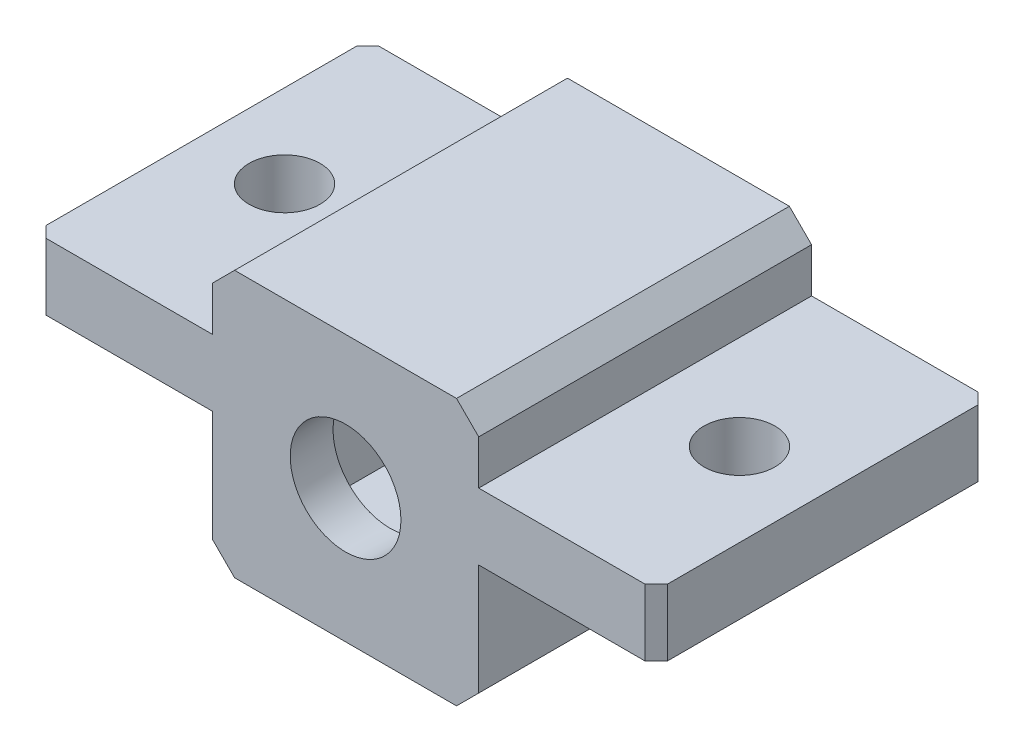
ISO-10303-21;
HEADER;
FILE_DESCRIPTION(('STEP AP214'),'2;1');
FILE_NAME('part.step','',(''),(''),'','','');
FILE_SCHEMA(('AUTOMOTIVE_DESIGN { 1 0 10303 214 1 1 1 1 }'));
ENDSEC;
DATA;
#1=APPLICATION_CONTEXT('core data for automotive mechanical design processes');
#2=APPLICATION_PROTOCOL_DEFINITION('international standard','automotive_design',2000,#1);
#3=PRODUCT_CONTEXT('',#1,'mechanical');
#4=PRODUCT('Part','Part','',(#3));
#5=PRODUCT_RELATED_PRODUCT_CATEGORY('part','',(#4));
#6=PRODUCT_DEFINITION_FORMATION('','',#4);
#7=PRODUCT_DEFINITION_CONTEXT('part definition',#1,'design');
#8=PRODUCT_DEFINITION('design','',#6,#7);
#9=PRODUCT_DEFINITION_SHAPE('','',#8);
#10=(LENGTH_UNIT() NAMED_UNIT(*) SI_UNIT(.MILLI.,.METRE.));
#11=(NAMED_UNIT(*) PLANE_ANGLE_UNIT() SI_UNIT($,.RADIAN.));
#12=(NAMED_UNIT(*) SI_UNIT($,.STERADIAN.) SOLID_ANGLE_UNIT());
#13=UNCERTAINTY_MEASURE_WITH_UNIT(LENGTH_MEASURE(1.E-05),#10,'distance_accuracy_value','');
#14=(GEOMETRIC_REPRESENTATION_CONTEXT(3) GLOBAL_UNCERTAINTY_ASSIGNED_CONTEXT((#13)) GLOBAL_UNIT_ASSIGNED_CONTEXT((#10,
#11,#12)) REPRESENTATION_CONTEXT('',''));
#15=CARTESIAN_POINT('',(0.,0.,0.));
#16=DIRECTION('',(0.,0.,1.));
#17=DIRECTION('',(1.,0.,0.));
#18=AXIS2_PLACEMENT_3D('',#15,#16,#17);
#19=CARTESIAN_POINT('',(-22.6304102547524,29.1826555023924,15.));
#20=DIRECTION('',(-1.,0.,0.));
#21=DIRECTION('',(0.,-1.,0.));
#22=AXIS2_PLACEMENT_3D('',#19,#20,#21);
#23=PLANE('',#22);
#24=DIRECTION('',(0.,1.,0.));
#25=VECTOR('',#24,1.);
#26=CARTESIAN_POINT('',(-22.6304102547524,29.1826555023924,15.));
#27=LINE('',#26,#25);
#28=CARTESIAN_POINT('',(-22.6304102547524,26.1826555023924,15.));
#29=VERTEX_POINT('',#28);
#30=CARTESIAN_POINT('',(-22.6304102547524,28.1826555023923,15.));
#31=VERTEX_POINT('',#30);
#32=EDGE_CURVE('E399',#29,#31,#27,.T.);
#33=ORIENTED_EDGE('',*,*,#32,.F.);
#34=DIRECTION('',(0.,0.,-1.));
#35=VECTOR('',#34,1.);
#36=CARTESIAN_POINT('',(-22.6304102547524,26.1826555023924,15.));
#37=LINE('',#36,#35);
#38=CARTESIAN_POINT('',(-22.6304102547524,26.1826555023923,0.));
#39=VERTEX_POINT('',#38);
#40=EDGE_CURVE('E221',#29,#39,#37,.T.);
#41=ORIENTED_EDGE('',*,*,#40,.T.);
#42=DIRECTION('',(0.,1.,0.));
#43=VECTOR('',#42,1.);
#44=CARTESIAN_POINT('',(-22.6304102547524,29.1826555023924,0.));
#45=LINE('',#44,#43);
#46=CARTESIAN_POINT('',(-22.6304102547524,28.1826555023923,0.));
#47=VERTEX_POINT('',#46);
#48=EDGE_CURVE('E229',#39,#47,#45,.T.);
#49=ORIENTED_EDGE('',*,*,#48,.T.);
#50=DIRECTION('',(0.,0.,1.));
#51=VECTOR('',#50,1.);
#52=CARTESIAN_POINT('',(-22.6304102547524,28.1826555023923,15.));
#53=LINE('',#52,#51);
#54=EDGE_CURVE('E243',#47,#31,#53,.T.);
#55=ORIENTED_EDGE('',*,*,#54,.T.);
#56=EDGE_LOOP('',(#33,#41,#49,#55));
#57=FACE_BOUND('',#56,.T.);
#58=ADVANCED_FACE('F37',(#57),#23,.F.);
#59=CARTESIAN_POINT('',(-34.6304102547524,29.1826555023924,15.));
#60=DIRECTION('',(1.,0.,0.));
#61=DIRECTION('',(0.,1.,0.));
#62=AXIS2_PLACEMENT_3D('',#59,#60,#61);
#63=PLANE('',#62);
#64=DIRECTION('',(0.,0.,1.));
#65=VECTOR('',#64,1.);
#66=CARTESIAN_POINT('',(-34.6304102547524,23.1826555023924,15.));
#67=LINE('',#66,#65);
#68=CARTESIAN_POINT('',(-34.6304102547524,23.1826555023924,0.));
#69=VERTEX_POINT('',#68);
#70=CARTESIAN_POINT('',(-34.6304102547524,23.1826555023924,15.));
#71=VERTEX_POINT('',#70);
#72=EDGE_CURVE('E344',#69,#71,#67,.T.);
#73=ORIENTED_EDGE('',*,*,#72,.F.);
#74=DIRECTION('',(0.,-1.,0.));
#75=VECTOR('',#74,1.);
#76=CARTESIAN_POINT('',(-34.6304102547524,29.1826555023924,0.));
#77=LINE('',#76,#75);
#78=CARTESIAN_POINT('',(-34.6304102547524,18.1826555023924,0.));
#79=VERTEX_POINT('',#78);
#80=EDGE_CURVE('E392',#69,#79,#77,.T.);
#81=ORIENTED_EDGE('',*,*,#80,.T.);
#82=DIRECTION('',(0.,0.,1.));
#83=VECTOR('',#82,1.);
#84=CARTESIAN_POINT('',(-34.6304102547524,18.1826555023924,15.));
#85=LINE('',#84,#83);
#86=CARTESIAN_POINT('',(-34.6304102547524,18.1826555023924,15.));
#87=VERTEX_POINT('',#86);
#88=EDGE_CURVE('E276',#79,#87,#85,.T.);
#89=ORIENTED_EDGE('',*,*,#88,.T.);
#90=DIRECTION('',(0.,-1.,0.));
#91=VECTOR('',#90,1.);
#92=CARTESIAN_POINT('',(-34.6304102547524,29.1826555023924,15.));
#93=LINE('',#92,#91);
#94=EDGE_CURVE('E232',#71,#87,#93,.T.);
#95=ORIENTED_EDGE('',*,*,#94,.F.);
#96=EDGE_LOOP('',(#73,#81,#89,#95));
#97=FACE_BOUND('',#96,.T.);
#98=ADVANCED_FACE('F412',(#97),#63,.F.);
#99=DIRECTION('',(0.,0.,-1.));
#100=VECTOR('',#99,1.);
#101=CARTESIAN_POINT('',(-34.6304102547524,26.1826555023924,15.));
#102=LINE('',#101,#100);
#103=CARTESIAN_POINT('',(-34.6304102547524,26.1826555023924,15.));
#104=VERTEX_POINT('',#103);
#105=CARTESIAN_POINT('',(-34.6304102547524,26.1826555023924,0.));
#106=VERTEX_POINT('',#105);
#107=EDGE_CURVE('E339',#104,#106,#102,.T.);
#108=ORIENTED_EDGE('',*,*,#107,.F.);
#109=CARTESIAN_POINT('',(-34.6304102547524,28.1826555023923,15.));
#110=VERTEX_POINT('',#109);
#111=EDGE_CURVE('E393',#110,#104,#93,.T.);
#112=ORIENTED_EDGE('',*,*,#111,.F.);
#113=DIRECTION('',(0.,0.,-1.));
#114=VECTOR('',#113,1.);
#115=CARTESIAN_POINT('',(-34.6304102547524,28.1826555023923,15.));
#116=LINE('',#115,#114);
#117=CARTESIAN_POINT('',(-34.6304102547524,28.1826555023923,0.));
#118=VERTEX_POINT('',#117);
#119=EDGE_CURVE('E279',#110,#118,#116,.T.);
#120=ORIENTED_EDGE('',*,*,#119,.T.);
#121=EDGE_CURVE('E403',#118,#106,#77,.T.);
#122=ORIENTED_EDGE('',*,*,#121,.T.);
#123=EDGE_LOOP('',(#108,#112,#120,#122));
#124=FACE_BOUND('',#123,.T.);
#125=ADVANCED_FACE('F442',(#124),#63,.F.);
#126=CARTESIAN_POINT('',(-28.6304102547524,23.1826555023924,12.));
#127=DIRECTION('',(0.,0.,-1.));
#128=DIRECTION('',(1.,0.,0.));
#129=AXIS2_PLACEMENT_3D('',#126,#127,#128);
#130=CONICAL_SURFACE('',#129,2.6,0.0349065850398866);
#131=CARTESIAN_POINT('',(-28.6304102547524,23.1826555023924,15.));
#132=DIRECTION('',(0.,0.,1.));
#133=DIRECTION('',(1.,0.,0.));
#134=AXIS2_PLACEMENT_3D('',#131,#132,#133);
#135=CIRCLE('',#134,2.49523769152476);
#136=CARTESIAN_POINT('',(-26.1351725632276,23.1826555023924,15.));
#137=VERTEX_POINT('',#136);
#138=EDGE_CURVE('E241',#137,#137,#135,.T.);
#139=ORIENTED_EDGE('',*,*,#138,.T.);
#140=EDGE_LOOP('',(#139));
#141=FACE_BOUND('',#140,.T.);
#142=CARTESIAN_POINT('',(-28.6304102547524,23.1826555023924,13.));
#143=DIRECTION('',(0.,0.,-1.));
#144=DIRECTION('',(-1.,0.,0.));
#145=AXIS2_PLACEMENT_3D('',#142,#143,#144);
#146=CIRCLE('',#145,2.56507923050825);
#147=CARTESIAN_POINT('',(-31.1954894852606,23.1826555023924,13.));
#148=VERTEX_POINT('',#147);
#149=EDGE_CURVE('E238',#148,#148,#146,.T.);
#150=ORIENTED_EDGE('',*,*,#149,.T.);
#151=EDGE_LOOP('',(#150));
#152=FACE_BOUND('',#151,.T.);
#153=ADVANCED_FACE('F454',(#141,#152),#130,.F.);
#154=CARTESIAN_POINT('',(-34.6304102547524,17.1826555023924,15.));
#155=DIRECTION('',(0.,1.,0.));
#156=DIRECTION('',(0.,0.,1.));
#157=AXIS2_PLACEMENT_3D('',#154,#155,#156);
#158=PLANE('',#157);
#159=DIRECTION('',(1.,0.,0.));
#160=VECTOR('',#159,1.);
#161=CARTESIAN_POINT('',(-34.6304102547524,17.1826555023924,0.));
#162=LINE('',#161,#160);
#163=CARTESIAN_POINT('',(-33.6304102547524,17.1826555023924,0.));
#164=VERTEX_POINT('',#163);
#165=CARTESIAN_POINT('',(-23.6304102547524,17.1826555023924,0.));
#166=VERTEX_POINT('',#165);
#167=EDGE_CURVE('E234',#164,#166,#162,.T.);
#168=ORIENTED_EDGE('',*,*,#167,.T.);
#169=DIRECTION('',(0.,0.,1.));
#170=VECTOR('',#169,1.);
#171=CARTESIAN_POINT('',(-23.6304102547524,17.1826555023924,15.));
#172=LINE('',#171,#170);
#173=CARTESIAN_POINT('',(-23.6304102547524,17.1826555023924,15.));
#174=VERTEX_POINT('',#173);
#175=EDGE_CURVE('E261',#166,#174,#172,.T.);
#176=ORIENTED_EDGE('',*,*,#175,.T.);
#177=DIRECTION('',(1.,0.,0.));
#178=VECTOR('',#177,1.);
#179=CARTESIAN_POINT('',(-34.6304102547524,17.1826555023924,15.));
#180=LINE('',#179,#178);
#181=CARTESIAN_POINT('',(-33.6304102547524,17.1826555023924,15.));
#182=VERTEX_POINT('',#181);
#183=EDGE_CURVE('E396',#182,#174,#180,.T.);
#184=ORIENTED_EDGE('',*,*,#183,.F.);
#185=DIRECTION('',(0.,0.,-1.));
#186=VECTOR('',#185,1.);
#187=CARTESIAN_POINT('',(-33.6304102547524,17.1826555023924,15.));
#188=LINE('',#187,#186);
#189=EDGE_CURVE('E258',#182,#164,#188,.T.);
#190=ORIENTED_EDGE('',*,*,#189,.T.);
#191=EDGE_LOOP('',(#168,#176,#184,#190));
#192=FACE_BOUND('',#191,.T.);
#193=ADVANCED_FACE('F426',(#192),#158,.F.);
#194=CARTESIAN_POINT('',(-22.6304102547524,18.1826555023924,0.));
#195=VERTEX_POINT('',#194);
#196=CARTESIAN_POINT('',(-22.6304102547524,23.1826555023924,0.));
#197=VERTEX_POINT('',#196);
#198=EDGE_CURVE('E207',#195,#197,#45,.T.);
#199=ORIENTED_EDGE('',*,*,#198,.T.);
#200=DIRECTION('',(0.,0.,1.));
#201=VECTOR('',#200,1.);
#202=CARTESIAN_POINT('',(-22.6304102547524,23.1826555023924,15.));
#203=LINE('',#202,#201);
#204=CARTESIAN_POINT('',(-22.6304102547524,23.1826555023924,15.));
#205=VERTEX_POINT('',#204);
#206=EDGE_CURVE('E215',#197,#205,#203,.T.);
#207=ORIENTED_EDGE('',*,*,#206,.T.);
#208=CARTESIAN_POINT('',(-22.6304102547524,18.1826555023924,15.));
#209=VERTEX_POINT('',#208);
#210=EDGE_CURVE('E400',#209,#205,#27,.T.);
#211=ORIENTED_EDGE('',*,*,#210,.F.);
#212=DIRECTION('',(0.,0.,-1.));
#213=VECTOR('',#212,1.);
#214=CARTESIAN_POINT('',(-22.6304102547524,18.1826555023924,15.));
#215=LINE('',#214,#213);
#216=EDGE_CURVE('E227',#209,#195,#215,.T.);
#217=ORIENTED_EDGE('',*,*,#216,.T.);
#218=EDGE_LOOP('',(#199,#207,#211,#217));
#219=FACE_BOUND('',#218,.T.);
#220=ADVANCED_FACE('F225',(#219),#23,.F.);
#221=CARTESIAN_POINT('',(-34.6304102547524,29.1826555023924,15.));
#222=DIRECTION('',(0.,-1.,0.));
#223=DIRECTION('',(0.,0.,-1.));
#224=AXIS2_PLACEMENT_3D('',#221,#222,#223);
#225=PLANE('',#224);
#226=DIRECTION('',(-1.,0.,0.));
#227=VECTOR('',#226,1.);
#228=CARTESIAN_POINT('',(-34.6304102547524,29.1826555023924,15.));
#229=LINE('',#228,#227);
#230=CARTESIAN_POINT('',(-23.6304102547524,29.1826555023924,15.));
#231=VERTEX_POINT('',#230);
#232=CARTESIAN_POINT('',(-33.6304102547524,29.1826555023924,15.));
#233=VERTEX_POINT('',#232);
#234=EDGE_CURVE('E246',#231,#233,#229,.T.);
#235=ORIENTED_EDGE('',*,*,#234,.F.);
#236=DIRECTION('',(0.,0.,-1.));
#237=VECTOR('',#236,1.);
#238=CARTESIAN_POINT('',(-23.6304102547524,29.1826555023924,15.));
#239=LINE('',#238,#237);
#240=CARTESIAN_POINT('',(-23.6304102547524,29.1826555023924,0.));
#241=VERTEX_POINT('',#240);
#242=EDGE_CURVE('E273',#231,#241,#239,.T.);
#243=ORIENTED_EDGE('',*,*,#242,.T.);
#244=DIRECTION('',(-1.,0.,0.));
#245=VECTOR('',#244,1.);
#246=CARTESIAN_POINT('',(-34.6304102547524,29.1826555023924,0.));
#247=LINE('',#246,#245);
#248=CARTESIAN_POINT('',(-33.6304102547524,29.1826555023924,0.));
#249=VERTEX_POINT('',#248);
#250=EDGE_CURVE('E228',#241,#249,#247,.T.);
#251=ORIENTED_EDGE('',*,*,#250,.T.);
#252=DIRECTION('',(0.,0.,1.));
#253=VECTOR('',#252,1.);
#254=CARTESIAN_POINT('',(-33.6304102547524,29.1826555023924,15.));
#255=LINE('',#254,#253);
#256=EDGE_CURVE('E271',#249,#233,#255,.T.);
#257=ORIENTED_EDGE('',*,*,#256,.T.);
#258=EDGE_LOOP('',(#235,#243,#251,#257));
#259=FACE_BOUND('',#258,.T.);
#260=ADVANCED_FACE('F448',(#259),#225,.F.);
#261=CARTESIAN_POINT('',(0.,0.,15.));
#262=DIRECTION('',(0.,0.,1.));
#263=DIRECTION('',(1.,0.,0.));
#264=AXIS2_PLACEMENT_3D('',#261,#262,#263);
#265=PLANE('',#264);
#266=ORIENTED_EDGE('',*,*,#138,.F.);
#267=EDGE_LOOP('',(#266));
#268=FACE_BOUND('',#267,.T.);
#269=DIRECTION('',(-1.,0.,0.));
#270=VECTOR('',#269,1.);
#271=CARTESIAN_POINT('',(-14.6304102547524,23.1826555023924,15.));
#272=LINE('',#271,#270);
#273=CARTESIAN_POINT('',(-15.1304102547524,23.1826555023924,15.));
#274=VERTEX_POINT('',#273);
#275=EDGE_CURVE('E211',#274,#205,#272,.T.);
#276=ORIENTED_EDGE('',*,*,#275,.F.);
#277=DIRECTION('',(0.,1.,0.));
#278=VECTOR('',#277,1.);
#279=CARTESIAN_POINT('',(-15.1304102547524,0.,15.));
#280=LINE('',#279,#278);
#281=CARTESIAN_POINT('',(-15.1304102547524,26.1826555023924,15.));
#282=VERTEX_POINT('',#281);
#283=EDGE_CURVE('E11',#274,#282,#280,.T.);
#284=ORIENTED_EDGE('',*,*,#283,.T.);
#285=DIRECTION('',(-1.,0.,0.));
#286=VECTOR('',#285,1.);
#287=CARTESIAN_POINT('',(-14.6304102547524,26.1826555023924,15.));
#288=LINE('',#287,#286);
#289=EDGE_CURVE('E319',#282,#29,#288,.T.);
#290=ORIENTED_EDGE('',*,*,#289,.T.);
#291=ORIENTED_EDGE('',*,*,#32,.T.);
#292=DIRECTION('',(0.707106781186545,-0.70710678118655,0.));
#293=VECTOR('',#292,1.);
#294=CARTESIAN_POINT('',(2.7761226238199,2.77612262381988,15.));
#295=LINE('',#294,#293);
#296=EDGE_CURVE('E267',#31,#231,#295,.F.);
#297=ORIENTED_EDGE('',*,*,#296,.T.);
#298=ORIENTED_EDGE('',*,*,#234,.T.);
#299=DIRECTION('',(0.707106781186549,0.707106781186546,0.));
#300=VECTOR('',#299,1.);
#301=CARTESIAN_POINT('',(-31.4065328785723,31.4065328785724,15.));
#302=LINE('',#301,#300);
#303=EDGE_CURVE('E265',#233,#110,#302,.F.);
#304=ORIENTED_EDGE('',*,*,#303,.T.);
#305=ORIENTED_EDGE('',*,*,#111,.T.);
#306=DIRECTION('',(1.,0.,0.));
#307=VECTOR('',#306,1.);
#308=CARTESIAN_POINT('',(-42.6304102547524,26.1826555023924,15.));
#309=LINE('',#308,#307);
#310=CARTESIAN_POINT('',(-42.1304102547524,26.1826555023924,15.));
#311=VERTEX_POINT('',#310);
#312=EDGE_CURVE('E357',#311,#104,#309,.T.);
#313=ORIENTED_EDGE('',*,*,#312,.F.);
#314=DIRECTION('',(0.,-1.,0.));
#315=VECTOR('',#314,1.);
#316=CARTESIAN_POINT('',(-42.1304102547524,0.,15.));
#317=LINE('',#316,#315);
#318=CARTESIAN_POINT('',(-42.1304102547524,23.1826555023924,15.));
#319=VERTEX_POINT('',#318);
#320=EDGE_CURVE('E298',#311,#319,#317,.T.);
#321=ORIENTED_EDGE('',*,*,#320,.T.);
#322=DIRECTION('',(1.,0.,0.));
#323=VECTOR('',#322,1.);
#324=CARTESIAN_POINT('',(-42.6304102547524,23.1826555023924,15.));
#325=LINE('',#324,#323);
#326=EDGE_CURVE('E347',#319,#71,#325,.T.);
#327=ORIENTED_EDGE('',*,*,#326,.T.);
#328=ORIENTED_EDGE('',*,*,#94,.T.);
#329=DIRECTION('',(-0.707106781186544,0.707106781186551,0.));
#330=VECTOR('',#329,1.);
#331=CARTESIAN_POINT('',(-8.2238773761802,-8.22387737618012,15.));
#332=LINE('',#331,#330);
#333=EDGE_CURVE('E263',#87,#182,#332,.F.);
#334=ORIENTED_EDGE('',*,*,#333,.T.);
#335=ORIENTED_EDGE('',*,*,#183,.T.);
#336=DIRECTION('',(-0.707106781186548,-0.707106781186548,0.));
#337=VECTOR('',#336,1.);
#338=CARTESIAN_POINT('',(-20.4065328785724,20.4065328785724,15.));
#339=LINE('',#338,#337);
#340=EDGE_CURVE('E269',#174,#209,#339,.F.);
#341=ORIENTED_EDGE('',*,*,#340,.T.);
#342=ORIENTED_EDGE('',*,*,#210,.T.);
#343=EDGE_LOOP('',(#276,#284,#290,#291,#297,#298,#304,#305,#313,#321,#327,#328,#334,#335,#341,#342));
#344=FACE_BOUND('',#343,.T.);
#345=ADVANCED_FACE('F423',(#268,#344),#265,.T.);
#346=CARTESIAN_POINT('',(0.,0.,0.));
#347=DIRECTION('',(0.,0.,1.));
#348=DIRECTION('',(1.,0.,0.));
#349=AXIS2_PLACEMENT_3D('',#346,#347,#348);
#350=PLANE('',#349);
#351=DIRECTION('',(-1.,0.,0.));
#352=VECTOR('',#351,1.);
#353=CARTESIAN_POINT('',(-24.6304102547524,19.1826555023924,0.));
#354=LINE('',#353,#352);
#355=CARTESIAN_POINT('',(-24.6304102547524,19.1826555023924,0.));
#356=VERTEX_POINT('',#355);
#357=CARTESIAN_POINT('',(-32.6304102547524,19.1826555023924,0.));
#358=VERTEX_POINT('',#357);
#359=EDGE_CURVE('E375',#356,#358,#354,.T.);
#360=ORIENTED_EDGE('',*,*,#359,.F.);
#361=DIRECTION('',(0.,-1.,0.));
#362=VECTOR('',#361,1.);
#363=CARTESIAN_POINT('',(-24.6304102547524,27.1826555023924,0.));
#364=LINE('',#363,#362);
#365=CARTESIAN_POINT('',(-24.6304102547524,27.1826555023924,0.));
#366=VERTEX_POINT('',#365);
#367=EDGE_CURVE('E359',#366,#356,#364,.T.);
#368=ORIENTED_EDGE('',*,*,#367,.F.);
#369=DIRECTION('',(1.,0.,0.));
#370=VECTOR('',#369,1.);
#371=CARTESIAN_POINT('',(-24.6304102547524,27.1826555023924,0.));
#372=LINE('',#371,#370);
#373=CARTESIAN_POINT('',(-32.6304102547524,27.1826555023924,0.));
#374=VERTEX_POINT('',#373);
#375=EDGE_CURVE('E364',#374,#366,#372,.T.);
#376=ORIENTED_EDGE('',*,*,#375,.F.);
#377=DIRECTION('',(0.,1.,0.));
#378=VECTOR('',#377,1.);
#379=CARTESIAN_POINT('',(-32.6304102547524,27.1826555023924,0.));
#380=LINE('',#379,#378);
#381=EDGE_CURVE('E378',#358,#374,#380,.T.);
#382=ORIENTED_EDGE('',*,*,#381,.F.);
#383=EDGE_LOOP('',(#360,#368,#376,#382));
#384=FACE_BOUND('',#383,.T.);
#385=DIRECTION('',(-1.,0.,0.));
#386=VECTOR('',#385,1.);
#387=CARTESIAN_POINT('',(-14.6304102547524,26.1826555023924,0.));
#388=LINE('',#387,#386);
#389=CARTESIAN_POINT('',(-15.1304102547524,26.1826555023924,0.));
#390=VERTEX_POINT('',#389);
#391=EDGE_CURVE('E212',#390,#39,#388,.T.);
#392=ORIENTED_EDGE('',*,*,#391,.F.);
#393=DIRECTION('',(0.,-1.,0.));
#394=VECTOR('',#393,1.);
#395=CARTESIAN_POINT('',(-15.1304102547524,23.1826555023924,0.));
#396=LINE('',#395,#394);
#397=CARTESIAN_POINT('',(-15.1304102547524,23.1826555023924,0.));
#398=VERTEX_POINT('',#397);
#399=EDGE_CURVE('E209',#390,#398,#396,.T.);
#400=ORIENTED_EDGE('',*,*,#399,.T.);
#401=DIRECTION('',(-1.,0.,0.));
#402=VECTOR('',#401,1.);
#403=CARTESIAN_POINT('',(-14.6304102547524,23.1826555023924,0.));
#404=LINE('',#403,#402);
#405=EDGE_CURVE('E202',#398,#197,#404,.T.);
#406=ORIENTED_EDGE('',*,*,#405,.T.);
#407=ORIENTED_EDGE('',*,*,#198,.F.);
#408=DIRECTION('',(0.707106781186548,0.707106781186548,0.));
#409=VECTOR('',#408,1.);
#410=CARTESIAN_POINT('',(-22.6304102547524,18.1826555023924,0.));
#411=LINE('',#410,#409);
#412=EDGE_CURVE('E256',#195,#166,#411,.F.);
#413=ORIENTED_EDGE('',*,*,#412,.T.);
#414=ORIENTED_EDGE('',*,*,#167,.F.);
#415=DIRECTION('',(0.707106781186544,-0.707106781186551,0.));
#416=VECTOR('',#415,1.);
#417=CARTESIAN_POINT('',(-33.6304102547524,17.1826555023924,0.));
#418=LINE('',#417,#416);
#419=EDGE_CURVE('E248',#164,#79,#418,.F.);
#420=ORIENTED_EDGE('',*,*,#419,.T.);
#421=ORIENTED_EDGE('',*,*,#80,.F.);
#422=DIRECTION('',(1.,0.,0.));
#423=VECTOR('',#422,1.);
#424=CARTESIAN_POINT('',(-42.6304102547524,23.1826555023924,0.));
#425=LINE('',#424,#423);
#426=CARTESIAN_POINT('',(-42.1304102547524,23.1826555023924,0.));
#427=VERTEX_POINT('',#426);
#428=EDGE_CURVE('E353',#427,#69,#425,.T.);
#429=ORIENTED_EDGE('',*,*,#428,.F.);
#430=DIRECTION('',(0.,1.,0.));
#431=VECTOR('',#430,1.);
#432=CARTESIAN_POINT('',(-42.1304102547524,26.1826555023924,0.));
#433=LINE('',#432,#431);
#434=CARTESIAN_POINT('',(-42.1304102547524,26.1826555023924,0.));
#435=VERTEX_POINT('',#434);
#436=EDGE_CURVE('E292',#427,#435,#433,.T.);
#437=ORIENTED_EDGE('',*,*,#436,.T.);
#438=DIRECTION('',(1.,0.,0.));
#439=VECTOR('',#438,1.);
#440=CARTESIAN_POINT('',(-42.6304102547524,26.1826555023924,0.));
#441=LINE('',#440,#439);
#442=EDGE_CURVE('E355',#435,#106,#441,.T.);
#443=ORIENTED_EDGE('',*,*,#442,.T.);
#444=ORIENTED_EDGE('',*,*,#121,.F.);
#445=DIRECTION('',(-0.707106781186549,-0.707106781186546,0.));
#446=VECTOR('',#445,1.);
#447=CARTESIAN_POINT('',(-34.6304102547524,28.1826555023923,0.));
#448=LINE('',#447,#446);
#449=EDGE_CURVE('E251',#118,#249,#448,.F.);
#450=ORIENTED_EDGE('',*,*,#449,.T.);
#451=ORIENTED_EDGE('',*,*,#250,.F.);
#452=DIRECTION('',(-0.707106781186545,0.70710678118655,0.));
#453=VECTOR('',#452,1.);
#454=CARTESIAN_POINT('',(-23.6304102547524,29.1826555023924,0.));
#455=LINE('',#454,#453);
#456=EDGE_CURVE('E253',#241,#47,#455,.F.);
#457=ORIENTED_EDGE('',*,*,#456,.T.);
#458=ORIENTED_EDGE('',*,*,#48,.F.);
#459=EDGE_LOOP('',(#392,#400,#406,#407,#413,#414,#420,#421,#429,#437,#443,#444,#450,#451,#457,#458));
#460=FACE_BOUND('',#459,.T.);
#461=ADVANCED_FACE('F205',(#384,#460),#350,.F.);
#462=CARTESIAN_POINT('',(-24.6304102547524,27.1826555023924,13.));
#463=DIRECTION('',(1.,0.,0.));
#464=DIRECTION('',(0.,0.,-1.));
#465=AXIS2_PLACEMENT_3D('',#462,#463,#464);
#466=PLANE('',#465);
#467=ORIENTED_EDGE('',*,*,#367,.T.);
#468=DIRECTION('',(0.,0.,-1.));
#469=VECTOR('',#468,1.);
#470=CARTESIAN_POINT('',(-24.6304102547524,19.1826555023924,13.));
#471=LINE('',#470,#469);
#472=CARTESIAN_POINT('',(-24.6304102547524,19.1826555023924,13.));
#473=VERTEX_POINT('',#472);
#474=EDGE_CURVE('E373',#473,#356,#471,.T.);
#475=ORIENTED_EDGE('',*,*,#474,.F.);
#476=DIRECTION('',(0.,-1.,0.));
#477=VECTOR('',#476,1.);
#478=CARTESIAN_POINT('',(-24.6304102547524,27.1826555023924,13.));
#479=LINE('',#478,#477);
#480=CARTESIAN_POINT('',(-24.6304102547524,27.1826555023924,13.));
#481=VERTEX_POINT('',#480);
#482=EDGE_CURVE('E360',#481,#473,#479,.T.);
#483=ORIENTED_EDGE('',*,*,#482,.F.);
#484=DIRECTION('',(0.,0.,-1.));
#485=VECTOR('',#484,1.);
#486=CARTESIAN_POINT('',(-24.6304102547524,27.1826555023924,13.));
#487=LINE('',#486,#485);
#488=EDGE_CURVE('E242',#481,#366,#487,.T.);
#489=ORIENTED_EDGE('',*,*,#488,.T.);
#490=EDGE_LOOP('',(#467,#475,#483,#489));
#491=FACE_BOUND('',#490,.T.);
#492=ADVANCED_FACE('F553',(#491),#466,.F.);
#493=CARTESIAN_POINT('',(-24.6304102547524,27.1826555023924,13.));
#494=DIRECTION('',(0.,1.,0.));
#495=DIRECTION('',(0.,0.,1.));
#496=AXIS2_PLACEMENT_3D('',#493,#494,#495);
#497=PLANE('',#496);
#498=ORIENTED_EDGE('',*,*,#375,.T.);
#499=ORIENTED_EDGE('',*,*,#488,.F.);
#500=DIRECTION('',(1.,0.,0.));
#501=VECTOR('',#500,1.);
#502=CARTESIAN_POINT('',(-24.6304102547524,27.1826555023924,13.));
#503=LINE('',#502,#501);
#504=CARTESIAN_POINT('',(-32.6304102547524,27.1826555023924,13.));
#505=VERTEX_POINT('',#504);
#506=EDGE_CURVE('E370',#505,#481,#503,.T.);
#507=ORIENTED_EDGE('',*,*,#506,.F.);
#508=DIRECTION('',(0.,0.,-1.));
#509=VECTOR('',#508,1.);
#510=CARTESIAN_POINT('',(-32.6304102547524,27.1826555023924,13.));
#511=LINE('',#510,#509);
#512=EDGE_CURVE('E384',#505,#374,#511,.T.);
#513=ORIENTED_EDGE('',*,*,#512,.T.);
#514=EDGE_LOOP('',(#498,#499,#507,#513));
#515=FACE_BOUND('',#514,.T.);
#516=ADVANCED_FACE('F557',(#515),#497,.F.);
#517=CARTESIAN_POINT('',(-32.6304102547524,27.1826555023924,13.));
#518=DIRECTION('',(-1.,0.,0.));
#519=DIRECTION('',(0.,-1.,0.));
#520=AXIS2_PLACEMENT_3D('',#517,#518,#519);
#521=PLANE('',#520);
#522=ORIENTED_EDGE('',*,*,#381,.T.);
#523=ORIENTED_EDGE('',*,*,#512,.F.);
#524=DIRECTION('',(0.,1.,0.));
#525=VECTOR('',#524,1.);
#526=CARTESIAN_POINT('',(-32.6304102547524,27.1826555023924,13.));
#527=LINE('',#526,#525);
#528=CARTESIAN_POINT('',(-32.6304102547524,19.1826555023924,13.));
#529=VERTEX_POINT('',#528);
#530=EDGE_CURVE('E367',#529,#505,#527,.T.);
#531=ORIENTED_EDGE('',*,*,#530,.F.);
#532=DIRECTION('',(0.,0.,-1.));
#533=VECTOR('',#532,1.);
#534=CARTESIAN_POINT('',(-32.6304102547524,19.1826555023924,13.));
#535=LINE('',#534,#533);
#536=EDGE_CURVE('E386',#529,#358,#535,.T.);
#537=ORIENTED_EDGE('',*,*,#536,.T.);
#538=EDGE_LOOP('',(#522,#523,#531,#537));
#539=FACE_BOUND('',#538,.T.);
#540=ADVANCED_FACE('F568',(#539),#521,.F.);
#541=CARTESIAN_POINT('',(-24.6304102547524,19.1826555023924,13.));
#542=DIRECTION('',(0.,-1.,0.));
#543=DIRECTION('',(0.,0.,-1.));
#544=AXIS2_PLACEMENT_3D('',#541,#542,#543);
#545=PLANE('',#544);
#546=ORIENTED_EDGE('',*,*,#359,.T.);
#547=ORIENTED_EDGE('',*,*,#536,.F.);
#548=DIRECTION('',(-1.,0.,0.));
#549=VECTOR('',#548,1.);
#550=CARTESIAN_POINT('',(-24.6304102547524,19.1826555023924,13.));
#551=LINE('',#550,#549);
#552=EDGE_CURVE('E363',#473,#529,#551,.T.);
#553=ORIENTED_EDGE('',*,*,#552,.F.);
#554=ORIENTED_EDGE('',*,*,#474,.T.);
#555=EDGE_LOOP('',(#546,#547,#553,#554));
#556=FACE_BOUND('',#555,.T.);
#557=ADVANCED_FACE('F578',(#556),#545,.F.);
#558=CARTESIAN_POINT('',(0.,0.,13.));
#559=DIRECTION('',(0.,0.,-1.));
#560=DIRECTION('',(-1.,0.,0.));
#561=AXIS2_PLACEMENT_3D('',#558,#559,#560);
#562=PLANE('',#561);
#563=ORIENTED_EDGE('',*,*,#149,.F.);
#564=EDGE_LOOP('',(#563));
#565=FACE_BOUND('',#564,.T.);
#566=ORIENTED_EDGE('',*,*,#482,.T.);
#567=ORIENTED_EDGE('',*,*,#552,.T.);
#568=ORIENTED_EDGE('',*,*,#530,.T.);
#569=ORIENTED_EDGE('',*,*,#506,.T.);
#570=EDGE_LOOP('',(#566,#567,#568,#569));
#571=FACE_BOUND('',#570,.T.);
#572=ADVANCED_FACE('F468',(#565,#571),#562,.T.);
#573=CARTESIAN_POINT('',(-22.6304102547524,18.1826555023924,15.));
#574=DIRECTION('',(-0.707106781186547,0.707106781186547,0.));
#575=DIRECTION('',(0.,0.,-1.));
#576=AXIS2_PLACEMENT_3D('',#573,#574,#575);
#577=PLANE('',#576);
#578=ORIENTED_EDGE('',*,*,#340,.F.);
#579=ORIENTED_EDGE('',*,*,#175,.F.);
#580=ORIENTED_EDGE('',*,*,#412,.F.);
#581=ORIENTED_EDGE('',*,*,#216,.F.);
#582=EDGE_LOOP('',(#578,#579,#580,#581));
#583=FACE_BOUND('',#582,.T.);
#584=ADVANCED_FACE('F429',(#583),#577,.F.);
#585=CARTESIAN_POINT('',(-23.6304102547524,29.1826555023924,15.));
#586=DIRECTION('',(-0.70710678118655,-0.707106781186545,0.));
#587=DIRECTION('',(0.,0.,-1.));
#588=AXIS2_PLACEMENT_3D('',#585,#586,#587);
#589=PLANE('',#588);
#590=ORIENTED_EDGE('',*,*,#296,.F.);
#591=ORIENTED_EDGE('',*,*,#54,.F.);
#592=ORIENTED_EDGE('',*,*,#456,.F.);
#593=ORIENTED_EDGE('',*,*,#242,.F.);
#594=EDGE_LOOP('',(#590,#591,#592,#593));
#595=FACE_BOUND('',#594,.T.);
#596=ADVANCED_FACE('F467',(#595),#589,.F.);
#597=CARTESIAN_POINT('',(-34.6304102547524,28.1826555023923,15.));
#598=DIRECTION('',(0.707106781186546,-0.707106781186549,0.));
#599=DIRECTION('',(0.,0.,-1.));
#600=AXIS2_PLACEMENT_3D('',#597,#598,#599);
#601=PLANE('',#600);
#602=ORIENTED_EDGE('',*,*,#303,.F.);
#603=ORIENTED_EDGE('',*,*,#256,.F.);
#604=ORIENTED_EDGE('',*,*,#449,.F.);
#605=ORIENTED_EDGE('',*,*,#119,.F.);
#606=EDGE_LOOP('',(#602,#603,#604,#605));
#607=FACE_BOUND('',#606,.T.);
#608=ADVANCED_FACE('F474',(#607),#601,.F.);
#609=CARTESIAN_POINT('',(-33.6304102547524,17.1826555023924,15.));
#610=DIRECTION('',(0.707106781186551,0.707106781186544,0.));
#611=DIRECTION('',(0.,0.,-1.));
#612=AXIS2_PLACEMENT_3D('',#609,#610,#611);
#613=PLANE('',#612);
#614=ORIENTED_EDGE('',*,*,#333,.F.);
#615=ORIENTED_EDGE('',*,*,#88,.F.);
#616=ORIENTED_EDGE('',*,*,#419,.F.);
#617=ORIENTED_EDGE('',*,*,#189,.F.);
#618=EDGE_LOOP('',(#614,#615,#616,#617));
#619=FACE_BOUND('',#618,.T.);
#620=ADVANCED_FACE('F420',(#619),#613,.F.);
#621=CARTESIAN_POINT('',(-42.6304102547524,26.1826555023924,15.));
#622=DIRECTION('',(0.,-1.,0.));
#623=DIRECTION('',(1.,0.,0.));
#624=AXIS2_PLACEMENT_3D('',#621,#622,#623);
#625=PLANE('',#624);
#626=CARTESIAN_POINT('',(-38.8804102547524,26.1826555023924,7.5));
#627=DIRECTION('',(0.,-1.,0.));
#628=DIRECTION('',(1.,0.,0.));
#629=AXIS2_PLACEMENT_3D('',#626,#627,#628);
#630=CIRCLE('',#629,1.6);
#631=CARTESIAN_POINT('',(-37.2804102547524,26.1826555023924,7.5));
#632=VERTEX_POINT('',#631);
#633=EDGE_CURVE('E336',#632,#632,#630,.T.);
#634=ORIENTED_EDGE('',*,*,#633,.T.);
#635=EDGE_LOOP('',(#634));
#636=FACE_BOUND('',#635,.T.);
#637=ORIENTED_EDGE('',*,*,#442,.F.);
#638=DIRECTION('',(-0.707106781186552,0.,0.707106781186543));
#639=VECTOR('',#638,1.);
#640=CARTESIAN_POINT('',(-42.6304102547524,26.1826555023924,0.49999999999999));
#641=LINE('',#640,#639);
#642=CARTESIAN_POINT('',(-42.6304102547524,26.1826555023924,0.5));
#643=VERTEX_POINT('',#642);
#644=EDGE_CURVE('E296',#435,#643,#641,.T.);
#645=ORIENTED_EDGE('',*,*,#644,.T.);
#646=DIRECTION('',(0.,0.,-1.));
#647=VECTOR('',#646,1.);
#648=CARTESIAN_POINT('',(-42.6304102547524,26.1826555023924,15.));
#649=LINE('',#648,#647);
#650=CARTESIAN_POINT('',(-42.6304102547524,26.1826555023924,14.5));
#651=VERTEX_POINT('',#650);
#652=EDGE_CURVE('E340',#651,#643,#649,.T.);
#653=ORIENTED_EDGE('',*,*,#652,.F.);
#654=DIRECTION('',(-0.707106781186545,0.,-0.70710678118655));
#655=VECTOR('',#654,1.);
#656=CARTESIAN_POINT('',(-42.6304102547524,26.1826555023924,14.5));
#657=LINE('',#656,#655);
#658=EDGE_CURVE('E294',#651,#311,#657,.F.);
#659=ORIENTED_EDGE('',*,*,#658,.T.);
#660=ORIENTED_EDGE('',*,*,#312,.T.);
#661=ORIENTED_EDGE('',*,*,#107,.T.);
#662=EDGE_LOOP('',(#637,#645,#653,#659,#660,#661));
#663=FACE_BOUND('',#662,.T.);
#664=ADVANCED_FACE('F487',(#636,#663),#625,.F.);
#665=CARTESIAN_POINT('',(-42.6304102547524,23.1826555023924,15.));
#666=DIRECTION('',(0.,1.,0.));
#667=DIRECTION('',(-1.,0.,0.));
#668=AXIS2_PLACEMENT_3D('',#665,#666,#667);
#669=PLANE('',#668);
#670=CARTESIAN_POINT('',(-38.8804102547524,23.1826555023924,7.5));
#671=DIRECTION('',(0.,-1.,0.));
#672=DIRECTION('',(1.,0.,0.));
#673=AXIS2_PLACEMENT_3D('',#670,#671,#672);
#674=CIRCLE('',#673,1.6);
#675=CARTESIAN_POINT('',(-37.2804102547524,23.1826555023924,7.5));
#676=VERTEX_POINT('',#675);
#677=EDGE_CURVE('E333',#676,#676,#674,.T.);
#678=ORIENTED_EDGE('',*,*,#677,.F.);
#679=EDGE_LOOP('',(#678));
#680=FACE_BOUND('',#679,.T.);
#681=DIRECTION('',(0.,0.,1.));
#682=VECTOR('',#681,1.);
#683=CARTESIAN_POINT('',(-42.6304102547524,23.1826555023924,15.));
#684=LINE('',#683,#682);
#685=CARTESIAN_POINT('',(-42.6304102547524,23.1826555023924,0.5));
#686=VERTEX_POINT('',#685);
#687=CARTESIAN_POINT('',(-42.6304102547524,23.1826555023924,14.5));
#688=VERTEX_POINT('',#687);
#689=EDGE_CURVE('E343',#686,#688,#684,.T.);
#690=ORIENTED_EDGE('',*,*,#689,.F.);
#691=DIRECTION('',(0.707106781186552,0.,-0.707106781186543));
#692=VECTOR('',#691,1.);
#693=CARTESIAN_POINT('',(-42.6304102547524,23.1826555023924,0.499999999999994));
#694=LINE('',#693,#692);
#695=EDGE_CURVE('E290',#686,#427,#694,.T.);
#696=ORIENTED_EDGE('',*,*,#695,.T.);
#697=ORIENTED_EDGE('',*,*,#428,.T.);
#698=ORIENTED_EDGE('',*,*,#72,.T.);
#699=ORIENTED_EDGE('',*,*,#326,.F.);
#700=DIRECTION('',(0.707106781186545,0.,0.70710678118655));
#701=VECTOR('',#700,1.);
#702=CARTESIAN_POINT('',(-42.6304102547524,23.1826555023924,14.5));
#703=LINE('',#702,#701);
#704=EDGE_CURVE('E288',#319,#688,#703,.F.);
#705=ORIENTED_EDGE('',*,*,#704,.T.);
#706=EDGE_LOOP('',(#690,#696,#697,#698,#699,#705));
#707=FACE_BOUND('',#706,.T.);
#708=ADVANCED_FACE('F517',(#680,#707),#669,.F.);
#709=CARTESIAN_POINT('',(-42.6304102547524,0.,0.));
#710=DIRECTION('',(-1.,0.,0.));
#711=DIRECTION('',(0.,0.,1.));
#712=AXIS2_PLACEMENT_3D('',#709,#710,#711);
#713=PLANE('',#712);
#714=ORIENTED_EDGE('',*,*,#652,.T.);
#715=DIRECTION('',(0.,-1.,0.));
#716=VECTOR('',#715,1.);
#717=CARTESIAN_POINT('',(-42.6304102547524,23.1826555023924,0.5));
#718=LINE('',#717,#716);
#719=EDGE_CURVE('E285',#643,#686,#718,.T.);
#720=ORIENTED_EDGE('',*,*,#719,.T.);
#721=ORIENTED_EDGE('',*,*,#689,.T.);
#722=DIRECTION('',(0.,1.,0.));
#723=VECTOR('',#722,1.);
#724=CARTESIAN_POINT('',(-42.6304102547524,0.,14.5));
#725=LINE('',#724,#723);
#726=EDGE_CURVE('E282',#688,#651,#725,.T.);
#727=ORIENTED_EDGE('',*,*,#726,.T.);
#728=EDGE_LOOP('',(#714,#720,#721,#727));
#729=FACE_BOUND('',#728,.T.);
#730=ADVANCED_FACE('F519',(#729),#713,.T.);
#731=CARTESIAN_POINT('',(-38.8804102547524,29.1826555023924,7.5));
#732=DIRECTION('',(0.,-1.,0.));
#733=DIRECTION('',(1.,0.,0.));
#734=AXIS2_PLACEMENT_3D('',#731,#732,#733);
#735=CYLINDRICAL_SURFACE('',#734,1.6);
#736=CARTESIAN_POINT('',(-37.2804102547524,23.1826555023924,7.5));
#737=CARTESIAN_POINT('',(-37.2804102547524,23.2139055023924,7.5));
#738=CARTESIAN_POINT('',(-37.2804102547524,23.2451555023924,7.5));
#739=CARTESIAN_POINT('',(-37.2804102547524,23.3076555023924,7.5));
#740=CARTESIAN_POINT('',(-37.2804102547524,23.3389055023924,7.5));
#741=CARTESIAN_POINT('',(-37.2804102547524,23.4014055023924,7.5));
#742=CARTESIAN_POINT('',(-37.2804102547524,23.4326555023924,7.5));
#743=CARTESIAN_POINT('',(-37.2804102547524,23.4951555023924,7.5));
#744=CARTESIAN_POINT('',(-37.2804102547524,23.5264055023924,7.5));
#745=CARTESIAN_POINT('',(-37.2804102547524,23.5889055023924,7.5));
#746=CARTESIAN_POINT('',(-37.2804102547524,23.6201555023924,7.5));
#747=CARTESIAN_POINT('',(-37.2804102547524,23.6826555023924,7.5));
#748=CARTESIAN_POINT('',(-37.2804102547524,23.7139055023924,7.5));
#749=CARTESIAN_POINT('',(-37.2804102547524,23.7764055023924,7.5));
#750=CARTESIAN_POINT('',(-37.2804102547524,23.8076555023924,7.5));
#751=CARTESIAN_POINT('',(-37.2804102547524,23.8701555023924,7.5));
#752=CARTESIAN_POINT('',(-37.2804102547524,23.9014055023924,7.5));
#753=CARTESIAN_POINT('',(-37.2804102547524,23.9639055023924,7.5));
#754=CARTESIAN_POINT('',(-37.2804102547524,23.9951555023924,7.5));
#755=CARTESIAN_POINT('',(-37.2804102547524,24.0576555023924,7.5));
#756=CARTESIAN_POINT('',(-37.2804102547524,24.0889055023924,7.5));
#757=CARTESIAN_POINT('',(-37.2804102547524,24.1514055023924,7.5));
#758=CARTESIAN_POINT('',(-37.2804102547524,24.1826555023924,7.5));
#759=CARTESIAN_POINT('',(-37.2804102547524,24.2451555023924,7.5));
#760=CARTESIAN_POINT('',(-37.2804102547524,24.2764055023924,7.5));
#761=CARTESIAN_POINT('',(-37.2804102547524,24.3389055023924,7.5));
#762=CARTESIAN_POINT('',(-37.2804102547524,24.3701555023924,7.5));
#763=CARTESIAN_POINT('',(-37.2804102547524,24.4326555023924,7.5));
#764=CARTESIAN_POINT('',(-37.2804102547524,24.4639055023924,7.5));
#765=CARTESIAN_POINT('',(-37.2804102547524,24.5264055023924,7.5));
#766=CARTESIAN_POINT('',(-37.2804102547524,24.5576555023924,7.5));
#767=CARTESIAN_POINT('',(-37.2804102547524,24.6201555023924,7.5));
#768=CARTESIAN_POINT('',(-37.2804102547524,24.6514055023924,7.5));
#769=CARTESIAN_POINT('',(-37.2804102547524,24.7139055023924,7.5));
#770=CARTESIAN_POINT('',(-37.2804102547524,24.7451555023924,7.5));
#771=CARTESIAN_POINT('',(-37.2804102547524,24.8076555023924,7.5));
#772=CARTESIAN_POINT('',(-37.2804102547524,24.8389055023924,7.5));
#773=CARTESIAN_POINT('',(-37.2804102547524,24.9014055023924,7.5));
#774=CARTESIAN_POINT('',(-37.2804102547524,24.9326555023924,7.5));
#775=CARTESIAN_POINT('',(-37.2804102547524,24.9951555023924,7.5));
#776=CARTESIAN_POINT('',(-37.2804102547524,25.0264055023924,7.5));
#777=CARTESIAN_POINT('',(-37.2804102547524,25.0889055023924,7.5));
#778=CARTESIAN_POINT('',(-37.2804102547524,25.1201555023924,7.5));
#779=CARTESIAN_POINT('',(-37.2804102547524,25.1826555023924,7.5));
#780=CARTESIAN_POINT('',(-37.2804102547524,25.2139055023924,7.5));
#781=CARTESIAN_POINT('',(-37.2804102547524,25.2764055023924,7.5));
#782=CARTESIAN_POINT('',(-37.2804102547524,25.3076555023924,7.5));
#783=CARTESIAN_POINT('',(-37.2804102547524,25.3701555023924,7.5));
#784=CARTESIAN_POINT('',(-37.2804102547524,25.4014055023924,7.5));
#785=CARTESIAN_POINT('',(-37.2804102547524,25.4639055023924,7.5));
#786=CARTESIAN_POINT('',(-37.2804102547524,25.4951555023924,7.5));
#787=CARTESIAN_POINT('',(-37.2804102547524,25.5576555023924,7.5));
#788=CARTESIAN_POINT('',(-37.2804102547524,25.5889055023924,7.5));
#789=CARTESIAN_POINT('',(-37.2804102547524,25.6514055023924,7.5));
#790=CARTESIAN_POINT('',(-37.2804102547524,25.6826555023924,7.5));
#791=CARTESIAN_POINT('',(-37.2804102547524,25.7451555023924,7.5));
#792=CARTESIAN_POINT('',(-37.2804102547524,25.7764055023924,7.5));
#793=CARTESIAN_POINT('',(-37.2804102547524,25.8389055023924,7.5));
#794=CARTESIAN_POINT('',(-37.2804102547524,25.8701555023924,7.5));
#795=CARTESIAN_POINT('',(-37.2804102547524,25.9326555023924,7.5));
#796=CARTESIAN_POINT('',(-37.2804102547524,25.9639055023924,7.5));
#797=CARTESIAN_POINT('',(-37.2804102547524,26.0264055023924,7.5));
#798=CARTESIAN_POINT('',(-37.2804102547524,26.0576555023924,7.5));
#799=CARTESIAN_POINT('',(-37.2804102547524,26.1201555023924,7.5));
#800=CARTESIAN_POINT('',(-37.2804102547524,26.1514055023924,7.5));
#801=CARTESIAN_POINT('',(-37.2804102547524,26.1826555023924,7.5));
#802=B_SPLINE_CURVE_WITH_KNOTS('',3,(#736,#737,#738,#739,#740,#741,#742,#743,#744,#745,#746,
#747,#748,#749,#750,#751,#752,#753,#754,#755,#756,#757,#758,#759,#760,#761,#762,#763,#764,#765,
#766,#767,#768,#769,#770,#771,#772,#773,#774,#775,#776,#777,#778,#779,#780,#781,#782,#783,#784,
#785,#786,#787,#788,#789,#790,#791,#792,#793,#794,#795,#796,#797,#798,#799,#800,#801),
.UNSPECIFIED.,.F.,.F.,(4,2,2,2,2,2,2,2,2,2,2,2,2,2,2,2,2,2,2,2,2,2,2,2,2,2,2,2,2,2,2,2,4),(0.,
0.0937500000000001,0.1875,0.28125,0.375,0.46875,0.5625,0.656250000000001,0.750000000000001,
0.843750000000001,0.937500000000001,1.03125,1.125,1.21875,1.3125,1.40625,1.5,1.59375,1.6875,
1.78125,1.875,1.96875,2.0625,2.15625,2.25,2.34375,2.4375,2.53125,2.625,2.71875,2.8125,2.90625,
3.),.UNSPECIFIED.);
#803=EDGE_CURVE('BSEAM495',#676,#632,#802,.T.);
#804=ORIENTED_EDGE('',*,*,#677,.T.);
#805=ORIENTED_EDGE('',*,*,#633,.F.);
#806=ORIENTED_EDGE('',*,*,#803,.T.);
#807=ORIENTED_EDGE('',*,*,#803,.F.);
#808=EDGE_LOOP('',(#804,#806,#805,#807));
#809=FACE_BOUND('',#808,.T.);
#810=ADVANCED_FACE('F495',(#809),#735,.F.);
#811=CARTESIAN_POINT('',(-42.6304102547524,0.,0.5));
#812=DIRECTION('',(-0.707106781186542,0.,-0.707106781186552));
#813=DIRECTION('',(0.,1.,0.));
#814=AXIS2_PLACEMENT_3D('',#811,#812,#813);
#815=PLANE('',#814);
#816=ORIENTED_EDGE('',*,*,#644,.F.);
#817=ORIENTED_EDGE('',*,*,#436,.F.);
#818=ORIENTED_EDGE('',*,*,#695,.F.);
#819=ORIENTED_EDGE('',*,*,#719,.F.);
#820=EDGE_LOOP('',(#816,#817,#818,#819));
#821=FACE_BOUND('',#820,.T.);
#822=ADVANCED_FACE('F488',(#821),#815,.T.);
#823=CARTESIAN_POINT('',(-42.6304102547524,0.,14.5));
#824=DIRECTION('',(0.70710678118655,0.,-0.707106781186545));
#825=DIRECTION('',(0.,1.,0.));
#826=AXIS2_PLACEMENT_3D('',#823,#824,#825);
#827=PLANE('',#826);
#828=ORIENTED_EDGE('',*,*,#704,.F.);
#829=ORIENTED_EDGE('',*,*,#320,.F.);
#830=ORIENTED_EDGE('',*,*,#658,.F.);
#831=ORIENTED_EDGE('',*,*,#726,.F.);
#832=EDGE_LOOP('',(#828,#829,#830,#831));
#833=FACE_BOUND('',#832,.T.);
#834=ADVANCED_FACE('F494',(#833),#827,.F.);
#835=CARTESIAN_POINT('',(-14.6304102547524,23.1826555023924,15.));
#836=DIRECTION('',(0.,-1.,0.));
#837=DIRECTION('',(1.,0.,0.));
#838=AXIS2_PLACEMENT_3D('',#835,#836,#837);
#839=PLANE('',#838);
#840=CARTESIAN_POINT('',(-18.3804102547524,23.1826555023924,7.5));
#841=DIRECTION('',(0.,1.,0.));
#842=DIRECTION('',(-1.,0.,0.));
#843=AXIS2_PLACEMENT_3D('',#840,#841,#842);
#844=CIRCLE('',#843,1.6);
#845=CARTESIAN_POINT('',(-19.9804102547524,23.1826555023924,7.5));
#846=VERTEX_POINT('',#845);
#847=EDGE_CURVE('E302',#846,#846,#844,.T.);
#848=ORIENTED_EDGE('',*,*,#847,.T.);
#849=EDGE_LOOP('',(#848));
#850=FACE_BOUND('',#849,.T.);
#851=ORIENTED_EDGE('',*,*,#405,.F.);
#852=DIRECTION('',(0.70710678118655,0.,0.707106781186545));
#853=VECTOR('',#852,1.);
#854=CARTESIAN_POINT('',(-7.38041025475239,23.1826555023924,7.74999999999995));
#855=LINE('',#854,#853);
#856=CARTESIAN_POINT('',(-14.6304102547524,23.1826555023924,0.5));
#857=VERTEX_POINT('',#856);
#858=EDGE_CURVE('E306',#398,#857,#855,.T.);
#859=ORIENTED_EDGE('',*,*,#858,.T.);
#860=DIRECTION('',(0.,0.,1.));
#861=VECTOR('',#860,1.);
#862=CARTESIAN_POINT('',(-14.6304102547524,23.1826555023924,15.));
#863=LINE('',#862,#861);
#864=CARTESIAN_POINT('',(-14.6304102547524,23.1826555023924,14.5));
#865=VERTEX_POINT('',#864);
#866=EDGE_CURVE('E323',#857,#865,#863,.T.);
#867=ORIENTED_EDGE('',*,*,#866,.T.);
#868=DIRECTION('',(0.70710678118655,0.,-0.707106781186545));
#869=VECTOR('',#868,1.);
#870=CARTESIAN_POINT('',(-14.8804102547524,23.1826555023924,14.75));
#871=LINE('',#870,#869);
#872=EDGE_CURVE('E304',#865,#274,#871,.F.);
#873=ORIENTED_EDGE('',*,*,#872,.T.);
#874=ORIENTED_EDGE('',*,*,#275,.T.);
#875=ORIENTED_EDGE('',*,*,#206,.F.);
#876=EDGE_LOOP('',(#851,#859,#867,#873,#874,#875));
#877=FACE_BOUND('',#876,.T.);
#878=ADVANCED_FACE('F216',(#850,#877),#839,.T.);
#879=CARTESIAN_POINT('',(-14.6304102547524,26.1826555023924,15.));
#880=DIRECTION('',(0.,1.,0.));
#881=DIRECTION('',(-1.,0.,0.));
#882=AXIS2_PLACEMENT_3D('',#879,#880,#881);
#883=PLANE('',#882);
#884=CARTESIAN_POINT('',(-18.3804102547524,26.1826555023924,7.5));
#885=DIRECTION('',(0.,1.,0.));
#886=DIRECTION('',(-1.,0.,0.));
#887=AXIS2_PLACEMENT_3D('',#884,#885,#886);
#888=CIRCLE('',#887,1.6);
#889=CARTESIAN_POINT('',(-19.9804102547524,26.1826555023924,7.5));
#890=VERTEX_POINT('',#889);
#891=EDGE_CURVE('E222',#890,#890,#888,.F.);
#892=ORIENTED_EDGE('',*,*,#891,.T.);
#893=EDGE_LOOP('',(#892));
#894=FACE_BOUND('',#893,.T.);
#895=DIRECTION('',(0.,0.,-1.));
#896=VECTOR('',#895,1.);
#897=CARTESIAN_POINT('',(-14.6304102547524,26.1826555023924,15.));
#898=LINE('',#897,#896);
#899=CARTESIAN_POINT('',(-14.6304102547524,26.1826555023924,14.5));
#900=VERTEX_POINT('',#899);
#901=CARTESIAN_POINT('',(-14.6304102547524,26.1826555023924,0.5));
#902=VERTEX_POINT('',#901);
#903=EDGE_CURVE('E316',#900,#902,#898,.T.);
#904=ORIENTED_EDGE('',*,*,#903,.T.);
#905=DIRECTION('',(-0.70710678118655,0.,-0.707106781186545));
#906=VECTOR('',#905,1.);
#907=CARTESIAN_POINT('',(-7.38041025475239,26.1826555023924,7.74999999999995));
#908=LINE('',#907,#906);
#909=EDGE_CURVE('E46',#902,#390,#908,.T.);
#910=ORIENTED_EDGE('',*,*,#909,.T.);
#911=ORIENTED_EDGE('',*,*,#391,.T.);
#912=ORIENTED_EDGE('',*,*,#40,.F.);
#913=ORIENTED_EDGE('',*,*,#289,.F.);
#914=DIRECTION('',(-0.70710678118655,0.,0.707106781186545));
#915=VECTOR('',#914,1.);
#916=CARTESIAN_POINT('',(-14.8804102547524,26.1826555023924,14.75));
#917=LINE('',#916,#915);
#918=EDGE_CURVE('E53',#282,#900,#917,.F.);
#919=ORIENTED_EDGE('',*,*,#918,.T.);
#920=EDGE_LOOP('',(#904,#910,#911,#912,#913,#919));
#921=FACE_BOUND('',#920,.T.);
#922=ADVANCED_FACE('F313',(#894,#921),#883,.T.);
#923=CARTESIAN_POINT('',(-14.6304102547524,0.,0.));
#924=DIRECTION('',(1.,0.,0.));
#925=DIRECTION('',(0.,0.,1.));
#926=AXIS2_PLACEMENT_3D('',#923,#924,#925);
#927=PLANE('',#926);
#928=ORIENTED_EDGE('',*,*,#866,.F.);
#929=DIRECTION('',(0.,1.,0.));
#930=VECTOR('',#929,1.);
#931=CARTESIAN_POINT('',(-14.6304102547524,26.1826555023924,0.5));
#932=LINE('',#931,#930);
#933=EDGE_CURVE('E60',#857,#902,#932,.T.);
#934=ORIENTED_EDGE('',*,*,#933,.T.);
#935=ORIENTED_EDGE('',*,*,#903,.F.);
#936=DIRECTION('',(0.,-1.,0.));
#937=VECTOR('',#936,1.);
#938=CARTESIAN_POINT('',(-14.6304102547524,0.,14.5));
#939=LINE('',#938,#937);
#940=EDGE_CURVE('E308',#900,#865,#939,.T.);
#941=ORIENTED_EDGE('',*,*,#940,.T.);
#942=EDGE_LOOP('',(#928,#934,#935,#941));
#943=FACE_BOUND('',#942,.T.);
#944=ADVANCED_FACE('F325',(#943),#927,.T.);
#945=CARTESIAN_POINT('',(-18.3804102547524,29.1826555023924,7.5));
#946=DIRECTION('',(0.,-1.,0.));
#947=DIRECTION('',(1.,0.,0.));
#948=AXIS2_PLACEMENT_3D('',#945,#946,#947);
#949=CYLINDRICAL_SURFACE('',#948,1.6);
#950=ORIENTED_EDGE('',*,*,#891,.F.);
#951=EDGE_LOOP('',(#950));
#952=FACE_BOUND('',#951,.T.);
#953=ORIENTED_EDGE('',*,*,#847,.F.);
#954=EDGE_LOOP('',(#953));
#955=FACE_BOUND('',#954,.T.);
#956=ADVANCED_FACE('F435',(#952,#955),#949,.F.);
#957=CARTESIAN_POINT('',(-15.1304102547524,0.,0.));
#958=DIRECTION('',(0.707106781186545,0.,-0.70710678118655));
#959=DIRECTION('',(0.,1.,0.));
#960=AXIS2_PLACEMENT_3D('',#957,#958,#959);
#961=PLANE('',#960);
#962=ORIENTED_EDGE('',*,*,#909,.F.);
#963=ORIENTED_EDGE('',*,*,#933,.F.);
#964=ORIENTED_EDGE('',*,*,#858,.F.);
#965=ORIENTED_EDGE('',*,*,#399,.F.);
#966=EDGE_LOOP('',(#962,#963,#964,#965));
#967=FACE_BOUND('',#966,.T.);
#968=ADVANCED_FACE('F321',(#967),#961,.T.);
#969=CARTESIAN_POINT('',(-15.1304102547524,0.,15.));
#970=DIRECTION('',(-0.707106781186545,0.,-0.70710678118655));
#971=DIRECTION('',(0.,1.,0.));
#972=AXIS2_PLACEMENT_3D('',#969,#970,#971);
#973=PLANE('',#972);
#974=ORIENTED_EDGE('',*,*,#872,.F.);
#975=ORIENTED_EDGE('',*,*,#940,.F.);
#976=ORIENTED_EDGE('',*,*,#918,.F.);
#977=ORIENTED_EDGE('',*,*,#283,.F.);
#978=EDGE_LOOP('',(#974,#975,#976,#977));
#979=FACE_BOUND('',#978,.T.);
#980=ADVANCED_FACE('F40',(#979),#973,.F.);
#981=CLOSED_SHELL('',(#58,#98,#125,#153,#193,#220,#260,#345,#461,#492,#516,#540,#557,#572,#584,
#596,#608,#620,#664,#708,#730,#810,#822,#834,#878,#922,#944,#956,#968,#980));
#982=MANIFOLD_SOLID_BREP('B2',#981);
#983=ADVANCED_BREP_SHAPE_REPRESENTATION('',(#18,#982),#14);
#984=SHAPE_DEFINITION_REPRESENTATION(#9,#983);
ENDSEC;
END-ISO-10303-21;
